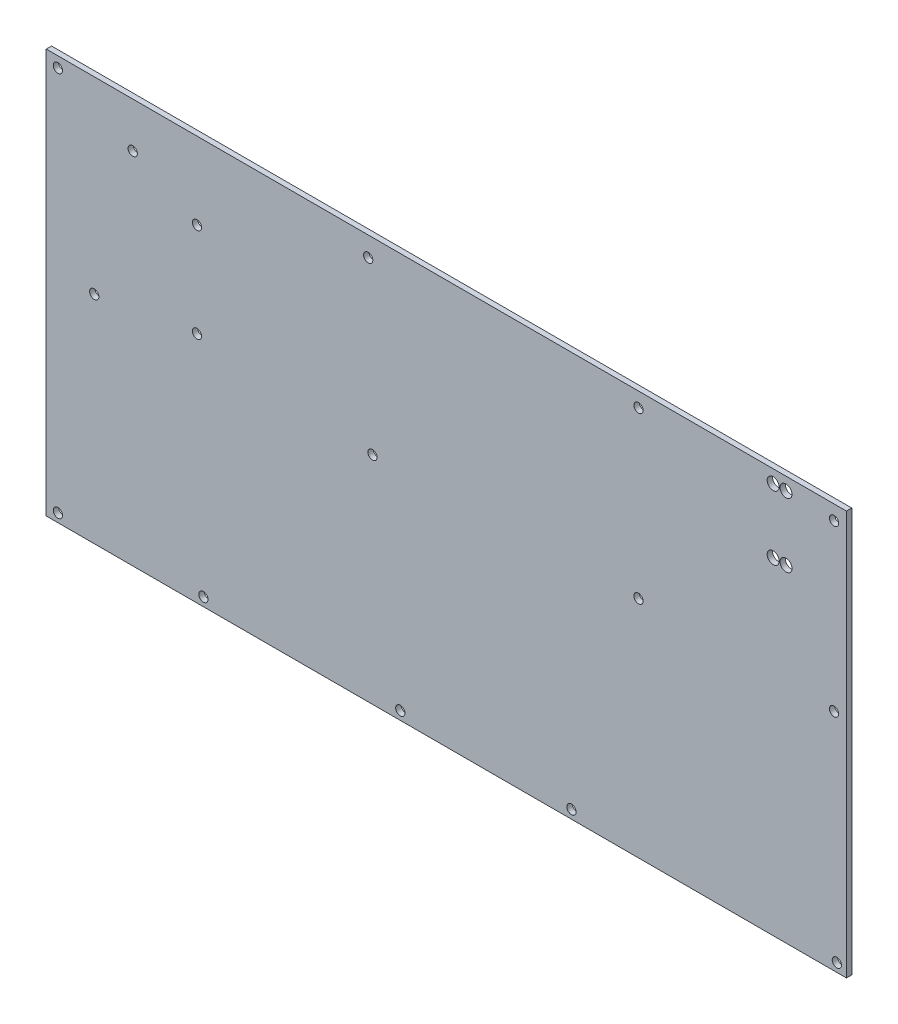
ISO-10303-21;
HEADER;
FILE_DESCRIPTION(('STEP AP214'),'2;1');
FILE_NAME('part.step','',(''),(''),'','','');
FILE_SCHEMA(('AUTOMOTIVE_DESIGN { 1 0 10303 214 1 1 1 1 }'));
ENDSEC;
DATA;
#1=APPLICATION_CONTEXT('core data for automotive mechanical design processes');
#2=APPLICATION_PROTOCOL_DEFINITION('international standard','automotive_design',2000,#1);
#3=PRODUCT_CONTEXT('',#1,'mechanical');
#4=PRODUCT('Part','Part','',(#3));
#5=PRODUCT_RELATED_PRODUCT_CATEGORY('part','',(#4));
#6=PRODUCT_DEFINITION_FORMATION('','',#4);
#7=PRODUCT_DEFINITION_CONTEXT('part definition',#1,'design');
#8=PRODUCT_DEFINITION('design','',#6,#7);
#9=PRODUCT_DEFINITION_SHAPE('','',#8);
#10=(LENGTH_UNIT() NAMED_UNIT(*) SI_UNIT(.MILLI.,.METRE.));
#11=(NAMED_UNIT(*) PLANE_ANGLE_UNIT() SI_UNIT($,.RADIAN.));
#12=(NAMED_UNIT(*) SI_UNIT($,.STERADIAN.) SOLID_ANGLE_UNIT());
#13=UNCERTAINTY_MEASURE_WITH_UNIT(LENGTH_MEASURE(1.E-05),#10,'distance_accuracy_value','');
#14=(GEOMETRIC_REPRESENTATION_CONTEXT(3) GLOBAL_UNCERTAINTY_ASSIGNED_CONTEXT((#13)) GLOBAL_UNIT_ASSIGNED_CONTEXT((#10,
#11,#12)) REPRESENTATION_CONTEXT('',''));
#15=CARTESIAN_POINT('',(0.,0.,0.));
#16=DIRECTION('',(0.,0.,1.));
#17=DIRECTION('',(1.,0.,0.));
#18=AXIS2_PLACEMENT_3D('',#15,#16,#17);
#19=CARTESIAN_POINT('',(0.,0.,7.5748));
#20=DIRECTION('',(0.,0.,-1.));
#21=DIRECTION('',(-1.,0.,0.));
#22=AXIS2_PLACEMENT_3D('',#19,#20,#21);
#23=PLANE('',#22);
#24=DIRECTION('',(0.,-1.,0.));
#25=VECTOR('',#24,1.);
#26=CARTESIAN_POINT('',(-39.9221568627452,-40.3820156862745,7.5748));
#27=LINE('',#26,#25);
#28=CARTESIAN_POINT('',(-39.9221568627452,79.6075843137255,7.5748));
#29=VERTEX_POINT('',#28);
#30=CARTESIAN_POINT('',(-39.9221568627452,-40.3820156862745,7.5748));
#31=VERTEX_POINT('',#30);
#32=EDGE_CURVE('E85',#29,#31,#27,.T.);
#33=ORIENTED_EDGE('',*,*,#32,.T.);
#34=DIRECTION('',(1.,0.,0.));
#35=VECTOR('',#34,1.);
#36=CARTESIAN_POINT('',(-39.9221568627452,-40.3820156862745,7.5748));
#37=LINE('',#36,#35);
#38=CARTESIAN_POINT('',(197.517043137255,-40.3820156862744,7.5748));
#39=VERTEX_POINT('',#38);
#40=EDGE_CURVE('E80',#31,#39,#37,.T.);
#41=ORIENTED_EDGE('',*,*,#40,.T.);
#42=DIRECTION('',(0.,1.,0.));
#43=VECTOR('',#42,1.);
#44=CARTESIAN_POINT('',(197.517043137255,-40.3820156862744,7.5748));
#45=LINE('',#44,#43);
#46=CARTESIAN_POINT('',(197.517043137255,79.6075843137255,7.5748));
#47=VERTEX_POINT('',#46);
#48=EDGE_CURVE('E83',#39,#47,#45,.T.);
#49=ORIENTED_EDGE('',*,*,#48,.T.);
#50=DIRECTION('',(-1.,0.,0.));
#51=VECTOR('',#50,1.);
#52=CARTESIAN_POINT('',(-39.9221568627452,79.6075843137255,7.5748));
#53=LINE('',#52,#51);
#54=EDGE_CURVE('E50',#47,#29,#53,.T.);
#55=ORIENTED_EDGE('',*,*,#54,.T.);
#56=EDGE_LOOP('',(#33,#41,#49,#55));
#57=FACE_BOUND('',#56,.T.);
#58=CARTESIAN_POINT('',(193.834043137255,75.2895843137255,7.5748));
#59=DIRECTION('',(0.,0.,1.));
#60=DIRECTION('',(1.,0.,0.));
#61=AXIS2_PLACEMENT_3D('',#58,#59,#60);
#62=CIRCLE('',#61,1.37159999999999);
#63=CARTESIAN_POINT('',(195.205643137255,75.2895843137255,7.5748));
#64=VERTEX_POINT('',#63);
#65=EDGE_CURVE('E100',#64,#64,#62,.T.);
#66=ORIENTED_EDGE('',*,*,#65,.F.);
#67=EDGE_LOOP('',(#66));
#68=FACE_BOUND('',#67,.T.);
#69=CARTESIAN_POINT('',(135.815363137255,75.2895843137255,7.5748));
#70=DIRECTION('',(0.,0.,1.));
#71=DIRECTION('',(1.,0.,0.));
#72=AXIS2_PLACEMENT_3D('',#69,#70,#71);
#73=CIRCLE('',#72,1.37159999999999);
#74=CARTESIAN_POINT('',(137.186963137255,75.2895843137255,7.5748));
#75=VERTEX_POINT('',#74);
#76=EDGE_CURVE('E115',#75,#75,#73,.T.);
#77=ORIENTED_EDGE('',*,*,#76,.F.);
#78=EDGE_LOOP('',(#77));
#79=FACE_BOUND('',#78,.T.);
#80=CARTESIAN_POINT('',(193.834043137255,26.2929843137255,7.5748));
#81=DIRECTION('',(0.,0.,1.));
#82=DIRECTION('',(1.,0.,0.));
#83=AXIS2_PLACEMENT_3D('',#80,#81,#82);
#84=CIRCLE('',#83,1.37159999999999);
#85=CARTESIAN_POINT('',(195.205643137255,26.2929843137255,7.5748));
#86=VERTEX_POINT('',#85);
#87=EDGE_CURVE('E121',#86,#86,#84,.T.);
#88=ORIENTED_EDGE('',*,*,#87,.F.);
#89=EDGE_LOOP('',(#88));
#90=FACE_BOUND('',#89,.T.);
#91=CARTESIAN_POINT('',(135.820443137255,26.2929843137255,7.5748));
#92=DIRECTION('',(0.,0.,1.));
#93=DIRECTION('',(1.,0.,0.));
#94=AXIS2_PLACEMENT_3D('',#91,#92,#93);
#95=CIRCLE('',#94,1.37159999999999);
#96=CARTESIAN_POINT('',(137.192043137255,26.2929843137255,7.5748));
#97=VERTEX_POINT('',#96);
#98=EDGE_CURVE('E127',#97,#97,#95,.T.);
#99=ORIENTED_EDGE('',*,*,#98,.F.);
#100=EDGE_LOOP('',(#99));
#101=FACE_BOUND('',#100,.T.);
#102=CARTESIAN_POINT('',(194.672243137255,-37.8420156862745,7.5748));
#103=DIRECTION('',(0.,0.,1.));
#104=DIRECTION('',(1.,0.,0.));
#105=AXIS2_PLACEMENT_3D('',#102,#103,#104);
#106=CIRCLE('',#105,1.37159999999999);
#107=CARTESIAN_POINT('',(196.043843137255,-37.8420156862745,7.5748));
#108=VERTEX_POINT('',#107);
#109=EDGE_CURVE('E133',#108,#108,#106,.T.);
#110=ORIENTED_EDGE('',*,*,#109,.F.);
#111=EDGE_LOOP('',(#110));
#112=FACE_BOUND('',#111,.T.);
#113=CARTESIAN_POINT('',(115.932243137255,-37.8420156862745,7.5748));
#114=DIRECTION('',(0.,0.,1.));
#115=DIRECTION('',(1.,0.,0.));
#116=AXIS2_PLACEMENT_3D('',#113,#114,#115);
#117=CIRCLE('',#116,1.37159999999999);
#118=CARTESIAN_POINT('',(117.303843137255,-37.8420156862745,7.5748));
#119=VERTEX_POINT('',#118);
#120=EDGE_CURVE('E139',#119,#119,#117,.T.);
#121=ORIENTED_EDGE('',*,*,#120,.F.);
#122=EDGE_LOOP('',(#121));
#123=FACE_BOUND('',#122,.T.);
#124=CARTESIAN_POINT('',(55.6072431372549,73.7909843137255,7.5748));
#125=DIRECTION('',(0.,0.,1.));
#126=DIRECTION('',(1.,0.,0.));
#127=AXIS2_PLACEMENT_3D('',#124,#125,#126);
#128=CIRCLE('',#127,1.3716);
#129=CARTESIAN_POINT('',(56.9788431372549,73.7909843137255,7.5748));
#130=VERTEX_POINT('',#129);
#131=EDGE_CURVE('E145',#130,#130,#128,.T.);
#132=ORIENTED_EDGE('',*,*,#131,.F.);
#133=EDGE_LOOP('',(#132));
#134=FACE_BOUND('',#133,.T.);
#135=CARTESIAN_POINT('',(56.8772431372549,23.7529843137255,7.5748));
#136=DIRECTION('',(0.,0.,1.));
#137=DIRECTION('',(1.,0.,0.));
#138=AXIS2_PLACEMENT_3D('',#135,#136,#137);
#139=CIRCLE('',#138,1.3716);
#140=CARTESIAN_POINT('',(58.2488431372549,23.7529843137255,7.5748));
#141=VERTEX_POINT('',#140);
#142=EDGE_CURVE('E151',#141,#141,#139,.T.);
#143=ORIENTED_EDGE('',*,*,#142,.F.);
#144=EDGE_LOOP('',(#143));
#145=FACE_BOUND('',#144,.T.);
#146=CARTESIAN_POINT('',(65.1322431372549,-37.8420156862745,7.5748));
#147=DIRECTION('',(0.,0.,1.));
#148=DIRECTION('',(1.,0.,0.));
#149=AXIS2_PLACEMENT_3D('',#146,#147,#148);
#150=CIRCLE('',#149,1.3716);
#151=CARTESIAN_POINT('',(66.5038431372549,-37.8420156862745,7.5748));
#152=VERTEX_POINT('',#151);
#153=EDGE_CURVE('E157',#152,#152,#150,.T.);
#154=ORIENTED_EDGE('',*,*,#153,.F.);
#155=EDGE_LOOP('',(#154));
#156=FACE_BOUND('',#155,.T.);
#157=CARTESIAN_POINT('',(4.80724313725489,56.7729843137255,7.5748));
#158=DIRECTION('',(0.,0.,1.));
#159=DIRECTION('',(1.,0.,0.));
#160=AXIS2_PLACEMENT_3D('',#157,#158,#159);
#161=CIRCLE('',#160,1.3716);
#162=CARTESIAN_POINT('',(6.1788431372549,56.7729843137255,7.5748));
#163=VERTEX_POINT('',#162);
#164=EDGE_CURVE('E163',#163,#163,#161,.T.);
#165=ORIENTED_EDGE('',*,*,#164,.F.);
#166=EDGE_LOOP('',(#165));
#167=FACE_BOUND('',#166,.T.);
#168=CARTESIAN_POINT('',(4.80724313725492,28.8329843137255,7.5748));
#169=DIRECTION('',(0.,0.,1.));
#170=DIRECTION('',(1.,0.,0.));
#171=AXIS2_PLACEMENT_3D('',#168,#169,#170);
#172=CIRCLE('',#171,1.3716);
#173=CARTESIAN_POINT('',(6.17884313725492,28.8329843137255,7.5748));
#174=VERTEX_POINT('',#173);
#175=EDGE_CURVE('E169',#174,#174,#172,.T.);
#176=ORIENTED_EDGE('',*,*,#175,.F.);
#177=EDGE_LOOP('',(#176));
#178=FACE_BOUND('',#177,.T.);
#179=CARTESIAN_POINT('',(6.71224313725488,-37.8420156862745,7.5748));
#180=DIRECTION('',(0.,0.,1.));
#181=DIRECTION('',(1.,0.,0.));
#182=AXIS2_PLACEMENT_3D('',#179,#180,#181);
#183=CIRCLE('',#182,1.3716);
#184=CARTESIAN_POINT('',(8.08384313725488,-37.8420156862745,7.5748));
#185=VERTEX_POINT('',#184);
#186=EDGE_CURVE('E175',#185,#185,#183,.T.);
#187=ORIENTED_EDGE('',*,*,#186,.F.);
#188=EDGE_LOOP('',(#187));
#189=FACE_BOUND('',#188,.T.);
#190=CARTESIAN_POINT('',(-14.2717788706648,66.2672357657925,7.5748));
#191=DIRECTION('',(0.,0.,1.));
#192=DIRECTION('',(1.,0.,0.));
#193=AXIS2_PLACEMENT_3D('',#190,#191,#192);
#194=CIRCLE('',#193,1.3716);
#195=CARTESIAN_POINT('',(-12.9001788706648,66.2672357657925,7.5748));
#196=VERTEX_POINT('',#195);
#197=EDGE_CURVE('E181',#196,#196,#194,.T.);
#198=ORIENTED_EDGE('',*,*,#197,.F.);
#199=EDGE_LOOP('',(#198));
#200=FACE_BOUND('',#199,.T.);
#201=CARTESIAN_POINT('',(-36.4677568627451,76.4833843137255,7.5748));
#202=DIRECTION('',(0.,0.,1.));
#203=DIRECTION('',(1.,0.,0.));
#204=AXIS2_PLACEMENT_3D('',#201,#202,#203);
#205=CIRCLE('',#204,1.3716);
#206=CARTESIAN_POINT('',(-35.0961568627451,76.4833843137255,7.5748));
#207=VERTEX_POINT('',#206);
#208=EDGE_CURVE('E187',#207,#207,#205,.T.);
#209=ORIENTED_EDGE('',*,*,#208,.F.);
#210=EDGE_LOOP('',(#209));
#211=FACE_BOUND('',#210,.T.);
#212=CARTESIAN_POINT('',(-25.6727568627451,23.7529843137255,7.5748));
#213=DIRECTION('',(0.,0.,1.));
#214=DIRECTION('',(1.,0.,0.));
#215=AXIS2_PLACEMENT_3D('',#212,#213,#214);
#216=CIRCLE('',#215,1.3716);
#217=CARTESIAN_POINT('',(-24.3011568627451,23.7529843137255,7.5748));
#218=VERTEX_POINT('',#217);
#219=EDGE_CURVE('E193',#218,#218,#216,.T.);
#220=ORIENTED_EDGE('',*,*,#219,.F.);
#221=EDGE_LOOP('',(#220));
#222=FACE_BOUND('',#221,.T.);
#223=CARTESIAN_POINT('',(-36.4677568627451,-37.8420156862745,7.5748));
#224=DIRECTION('',(0.,0.,1.));
#225=DIRECTION('',(1.,0.,0.));
#226=AXIS2_PLACEMENT_3D('',#223,#224,#225);
#227=CIRCLE('',#226,1.3716);
#228=CARTESIAN_POINT('',(-35.0961568627451,-37.8420156862745,7.5748));
#229=VERTEX_POINT('',#228);
#230=EDGE_CURVE('E199',#229,#229,#227,.T.);
#231=ORIENTED_EDGE('',*,*,#230,.F.);
#232=EDGE_LOOP('',(#231));
#233=FACE_BOUND('',#232,.T.);
#234=CARTESIAN_POINT('',(179.584643137255,75.8229843137255,7.5748));
#235=DIRECTION('',(0.,0.,1.));
#236=DIRECTION('',(1.,0.,0.));
#237=AXIS2_PLACEMENT_3D('',#234,#235,#236);
#238=CIRCLE('',#237,1.778);
#239=CARTESIAN_POINT('',(181.362643137255,75.8229843137255,7.5748));
#240=VERTEX_POINT('',#239);
#241=EDGE_CURVE('E205',#240,#240,#238,.T.);
#242=ORIENTED_EDGE('',*,*,#241,.F.);
#243=EDGE_LOOP('',(#242));
#244=FACE_BOUND('',#243,.T.);
#245=CARTESIAN_POINT('',(175.774643137255,75.7975843137255,7.5748));
#246=DIRECTION('',(0.,0.,1.));
#247=DIRECTION('',(1.,0.,0.));
#248=AXIS2_PLACEMENT_3D('',#245,#246,#247);
#249=CIRCLE('',#248,1.778);
#250=CARTESIAN_POINT('',(177.552643137255,75.7975843137255,7.5748));
#251=VERTEX_POINT('',#250);
#252=EDGE_CURVE('E211',#251,#251,#249,.T.);
#253=ORIENTED_EDGE('',*,*,#252,.F.);
#254=EDGE_LOOP('',(#253));
#255=FACE_BOUND('',#254,.T.);
#256=CARTESIAN_POINT('',(179.584643137255,56.7475843137255,7.5748));
#257=DIRECTION('',(0.,0.,1.));
#258=DIRECTION('',(1.,0.,0.));
#259=AXIS2_PLACEMENT_3D('',#256,#257,#258);
#260=CIRCLE('',#259,1.77800000000001);
#261=CARTESIAN_POINT('',(181.362643137255,56.7475843137255,7.5748));
#262=VERTEX_POINT('',#261);
#263=EDGE_CURVE('E217',#262,#262,#260,.T.);
#264=ORIENTED_EDGE('',*,*,#263,.F.);
#265=EDGE_LOOP('',(#264));
#266=FACE_BOUND('',#265,.T.);
#267=CARTESIAN_POINT('',(175.774643137255,56.7475843137255,7.5748));
#268=DIRECTION('',(0.,0.,1.));
#269=DIRECTION('',(1.,0.,0.));
#270=AXIS2_PLACEMENT_3D('',#267,#268,#269);
#271=CIRCLE('',#270,1.77800000000001);
#272=CARTESIAN_POINT('',(177.552643137255,56.7475843137255,7.5748));
#273=VERTEX_POINT('',#272);
#274=EDGE_CURVE('E223',#273,#273,#271,.T.);
#275=ORIENTED_EDGE('',*,*,#274,.F.);
#276=EDGE_LOOP('',(#275));
#277=FACE_BOUND('',#276,.T.);
#278=ADVANCED_FACE('F33',(#57,#68,#79,#90,#101,#112,#123,#134,#145,#156,#167,#178,#189,#200,
#211,#222,#233,#244,#255,#266,#277),#23,.F.);
#279=CARTESIAN_POINT('',(0.,0.,6.));
#280=DIRECTION('',(0.,0.,-1.));
#281=DIRECTION('',(-1.,0.,0.));
#282=AXIS2_PLACEMENT_3D('',#279,#280,#281);
#283=PLANE('',#282);
#284=CARTESIAN_POINT('',(179.584643137255,56.7475843137255,6.));
#285=DIRECTION('',(0.,0.,1.));
#286=DIRECTION('',(1.,0.,0.));
#287=AXIS2_PLACEMENT_3D('',#284,#285,#286);
#288=CIRCLE('',#287,1.77800000000001);
#289=CARTESIAN_POINT('',(181.362643137255,56.7475843137255,6.));
#290=VERTEX_POINT('',#289);
#291=EDGE_CURVE('E220',#290,#290,#288,.T.);
#292=ORIENTED_EDGE('',*,*,#291,.T.);
#293=EDGE_LOOP('',(#292));
#294=FACE_BOUND('',#293,.T.);
#295=CARTESIAN_POINT('',(179.584643137255,75.8229843137255,6.));
#296=DIRECTION('',(0.,0.,1.));
#297=DIRECTION('',(1.,0.,0.));
#298=AXIS2_PLACEMENT_3D('',#295,#296,#297);
#299=CIRCLE('',#298,1.778);
#300=CARTESIAN_POINT('',(181.362643137255,75.8229843137255,6.));
#301=VERTEX_POINT('',#300);
#302=EDGE_CURVE('E208',#301,#301,#299,.T.);
#303=ORIENTED_EDGE('',*,*,#302,.T.);
#304=EDGE_LOOP('',(#303));
#305=FACE_BOUND('',#304,.T.);
#306=CARTESIAN_POINT('',(-25.6727568627451,23.7529843137255,6.));
#307=DIRECTION('',(0.,0.,1.));
#308=DIRECTION('',(1.,0.,0.));
#309=AXIS2_PLACEMENT_3D('',#306,#307,#308);
#310=CIRCLE('',#309,1.3716);
#311=CARTESIAN_POINT('',(-24.3011568627451,23.7529843137255,6.));
#312=VERTEX_POINT('',#311);
#313=EDGE_CURVE('E196',#312,#312,#310,.T.);
#314=ORIENTED_EDGE('',*,*,#313,.T.);
#315=EDGE_LOOP('',(#314));
#316=FACE_BOUND('',#315,.T.);
#317=CARTESIAN_POINT('',(-14.2717788706648,66.2672357657925,6.));
#318=DIRECTION('',(0.,0.,1.));
#319=DIRECTION('',(1.,0.,0.));
#320=AXIS2_PLACEMENT_3D('',#317,#318,#319);
#321=CIRCLE('',#320,1.3716);
#322=CARTESIAN_POINT('',(-12.9001788706648,66.2672357657925,6.));
#323=VERTEX_POINT('',#322);
#324=EDGE_CURVE('E184',#323,#323,#321,.T.);
#325=ORIENTED_EDGE('',*,*,#324,.T.);
#326=EDGE_LOOP('',(#325));
#327=FACE_BOUND('',#326,.T.);
#328=CARTESIAN_POINT('',(4.80724313725492,28.8329843137255,6.));
#329=DIRECTION('',(0.,0.,1.));
#330=DIRECTION('',(1.,0.,0.));
#331=AXIS2_PLACEMENT_3D('',#328,#329,#330);
#332=CIRCLE('',#331,1.3716);
#333=CARTESIAN_POINT('',(6.17884313725492,28.8329843137255,6.));
#334=VERTEX_POINT('',#333);
#335=EDGE_CURVE('E172',#334,#334,#332,.T.);
#336=ORIENTED_EDGE('',*,*,#335,.T.);
#337=EDGE_LOOP('',(#336));
#338=FACE_BOUND('',#337,.T.);
#339=CARTESIAN_POINT('',(65.1322431372549,-37.8420156862745,6.));
#340=DIRECTION('',(0.,0.,1.));
#341=DIRECTION('',(1.,0.,0.));
#342=AXIS2_PLACEMENT_3D('',#339,#340,#341);
#343=CIRCLE('',#342,1.3716);
#344=CARTESIAN_POINT('',(66.5038431372549,-37.8420156862745,6.));
#345=VERTEX_POINT('',#344);
#346=EDGE_CURVE('E160',#345,#345,#343,.T.);
#347=ORIENTED_EDGE('',*,*,#346,.T.);
#348=EDGE_LOOP('',(#347));
#349=FACE_BOUND('',#348,.T.);
#350=CARTESIAN_POINT('',(55.6072431372549,73.7909843137255,6.));
#351=DIRECTION('',(0.,0.,1.));
#352=DIRECTION('',(1.,0.,0.));
#353=AXIS2_PLACEMENT_3D('',#350,#351,#352);
#354=CIRCLE('',#353,1.3716);
#355=CARTESIAN_POINT('',(56.9788431372549,73.7909843137255,6.));
#356=VERTEX_POINT('',#355);
#357=EDGE_CURVE('E148',#356,#356,#354,.T.);
#358=ORIENTED_EDGE('',*,*,#357,.T.);
#359=EDGE_LOOP('',(#358));
#360=FACE_BOUND('',#359,.T.);
#361=CARTESIAN_POINT('',(194.672243137255,-37.8420156862745,6.));
#362=DIRECTION('',(0.,0.,1.));
#363=DIRECTION('',(1.,0.,0.));
#364=AXIS2_PLACEMENT_3D('',#361,#362,#363);
#365=CIRCLE('',#364,1.37159999999999);
#366=CARTESIAN_POINT('',(196.043843137255,-37.8420156862745,6.));
#367=VERTEX_POINT('',#366);
#368=EDGE_CURVE('E136',#367,#367,#365,.T.);
#369=ORIENTED_EDGE('',*,*,#368,.T.);
#370=EDGE_LOOP('',(#369));
#371=FACE_BOUND('',#370,.T.);
#372=CARTESIAN_POINT('',(193.834043137255,26.2929843137255,6.));
#373=DIRECTION('',(0.,0.,1.));
#374=DIRECTION('',(1.,0.,0.));
#375=AXIS2_PLACEMENT_3D('',#372,#373,#374);
#376=CIRCLE('',#375,1.37159999999999);
#377=CARTESIAN_POINT('',(195.205643137255,26.2929843137255,6.));
#378=VERTEX_POINT('',#377);
#379=EDGE_CURVE('E124',#378,#378,#376,.T.);
#380=ORIENTED_EDGE('',*,*,#379,.T.);
#381=EDGE_LOOP('',(#380));
#382=FACE_BOUND('',#381,.T.);
#383=CARTESIAN_POINT('',(193.834043137255,75.2895843137255,6.));
#384=DIRECTION('',(0.,0.,1.));
#385=DIRECTION('',(1.,0.,0.));
#386=AXIS2_PLACEMENT_3D('',#383,#384,#385);
#387=CIRCLE('',#386,1.37159999999999);
#388=CARTESIAN_POINT('',(195.205643137255,75.2895843137255,6.));
#389=VERTEX_POINT('',#388);
#390=EDGE_CURVE('E112',#389,#389,#387,.T.);
#391=ORIENTED_EDGE('',*,*,#390,.T.);
#392=EDGE_LOOP('',(#391));
#393=FACE_BOUND('',#392,.T.);
#394=DIRECTION('',(0.,-1.,0.));
#395=VECTOR('',#394,1.);
#396=CARTESIAN_POINT('',(-39.9221568627452,-40.3820156862745,6.));
#397=LINE('',#396,#395);
#398=CARTESIAN_POINT('',(-39.9221568627452,79.6075843137255,6.));
#399=VERTEX_POINT('',#398);
#400=CARTESIAN_POINT('',(-39.9221568627452,-40.3820156862745,6.));
#401=VERTEX_POINT('',#400);
#402=EDGE_CURVE('E97',#399,#401,#397,.T.);
#403=ORIENTED_EDGE('',*,*,#402,.F.);
#404=DIRECTION('',(-1.,0.,0.));
#405=VECTOR('',#404,1.);
#406=CARTESIAN_POINT('',(-39.9221568627452,79.6075843137255,6.));
#407=LINE('',#406,#405);
#408=CARTESIAN_POINT('',(197.517043137255,79.6075843137255,6.));
#409=VERTEX_POINT('',#408);
#410=EDGE_CURVE('E73',#409,#399,#407,.T.);
#411=ORIENTED_EDGE('',*,*,#410,.F.);
#412=DIRECTION('',(0.,1.,0.));
#413=VECTOR('',#412,1.);
#414=CARTESIAN_POINT('',(197.517043137255,-40.3820156862744,6.));
#415=LINE('',#414,#413);
#416=CARTESIAN_POINT('',(197.517043137255,-40.3820156862744,6.));
#417=VERTEX_POINT('',#416);
#418=EDGE_CURVE('E67',#417,#409,#415,.T.);
#419=ORIENTED_EDGE('',*,*,#418,.F.);
#420=DIRECTION('',(1.,0.,0.));
#421=VECTOR('',#420,1.);
#422=CARTESIAN_POINT('',(-39.9221568627452,-40.3820156862745,6.));
#423=LINE('',#422,#421);
#424=EDGE_CURVE('E89',#401,#417,#423,.T.);
#425=ORIENTED_EDGE('',*,*,#424,.F.);
#426=EDGE_LOOP('',(#403,#411,#419,#425));
#427=FACE_BOUND('',#426,.T.);
#428=CARTESIAN_POINT('',(135.815363137255,75.2895843137255,6.));
#429=DIRECTION('',(0.,0.,1.));
#430=DIRECTION('',(1.,0.,0.));
#431=AXIS2_PLACEMENT_3D('',#428,#429,#430);
#432=CIRCLE('',#431,1.37159999999999);
#433=CARTESIAN_POINT('',(137.186963137255,75.2895843137255,6.));
#434=VERTEX_POINT('',#433);
#435=EDGE_CURVE('E118',#434,#434,#432,.T.);
#436=ORIENTED_EDGE('',*,*,#435,.T.);
#437=EDGE_LOOP('',(#436));
#438=FACE_BOUND('',#437,.T.);
#439=CARTESIAN_POINT('',(135.820443137255,26.2929843137255,6.));
#440=DIRECTION('',(0.,0.,1.));
#441=DIRECTION('',(1.,0.,0.));
#442=AXIS2_PLACEMENT_3D('',#439,#440,#441);
#443=CIRCLE('',#442,1.37159999999999);
#444=CARTESIAN_POINT('',(137.192043137255,26.2929843137255,6.));
#445=VERTEX_POINT('',#444);
#446=EDGE_CURVE('E130',#445,#445,#443,.T.);
#447=ORIENTED_EDGE('',*,*,#446,.T.);
#448=EDGE_LOOP('',(#447));
#449=FACE_BOUND('',#448,.T.);
#450=CARTESIAN_POINT('',(115.932243137255,-37.8420156862745,6.));
#451=DIRECTION('',(0.,0.,1.));
#452=DIRECTION('',(1.,0.,0.));
#453=AXIS2_PLACEMENT_3D('',#450,#451,#452);
#454=CIRCLE('',#453,1.37159999999999);
#455=CARTESIAN_POINT('',(117.303843137255,-37.8420156862745,6.));
#456=VERTEX_POINT('',#455);
#457=EDGE_CURVE('E142',#456,#456,#454,.T.);
#458=ORIENTED_EDGE('',*,*,#457,.T.);
#459=EDGE_LOOP('',(#458));
#460=FACE_BOUND('',#459,.T.);
#461=CARTESIAN_POINT('',(56.8772431372549,23.7529843137255,6.));
#462=DIRECTION('',(0.,0.,1.));
#463=DIRECTION('',(1.,0.,0.));
#464=AXIS2_PLACEMENT_3D('',#461,#462,#463);
#465=CIRCLE('',#464,1.3716);
#466=CARTESIAN_POINT('',(58.2488431372549,23.7529843137255,6.));
#467=VERTEX_POINT('',#466);
#468=EDGE_CURVE('E154',#467,#467,#465,.T.);
#469=ORIENTED_EDGE('',*,*,#468,.T.);
#470=EDGE_LOOP('',(#469));
#471=FACE_BOUND('',#470,.T.);
#472=CARTESIAN_POINT('',(4.80724313725489,56.7729843137255,6.));
#473=DIRECTION('',(0.,0.,1.));
#474=DIRECTION('',(1.,0.,0.));
#475=AXIS2_PLACEMENT_3D('',#472,#473,#474);
#476=CIRCLE('',#475,1.3716);
#477=CARTESIAN_POINT('',(6.1788431372549,56.7729843137255,6.));
#478=VERTEX_POINT('',#477);
#479=EDGE_CURVE('E166',#478,#478,#476,.T.);
#480=ORIENTED_EDGE('',*,*,#479,.T.);
#481=EDGE_LOOP('',(#480));
#482=FACE_BOUND('',#481,.T.);
#483=CARTESIAN_POINT('',(6.71224313725488,-37.8420156862745,6.));
#484=DIRECTION('',(0.,0.,1.));
#485=DIRECTION('',(1.,0.,0.));
#486=AXIS2_PLACEMENT_3D('',#483,#484,#485);
#487=CIRCLE('',#486,1.3716);
#488=CARTESIAN_POINT('',(8.08384313725488,-37.8420156862745,6.));
#489=VERTEX_POINT('',#488);
#490=EDGE_CURVE('E178',#489,#489,#487,.T.);
#491=ORIENTED_EDGE('',*,*,#490,.T.);
#492=EDGE_LOOP('',(#491));
#493=FACE_BOUND('',#492,.T.);
#494=CARTESIAN_POINT('',(-36.4677568627451,76.4833843137255,6.));
#495=DIRECTION('',(0.,0.,1.));
#496=DIRECTION('',(1.,0.,0.));
#497=AXIS2_PLACEMENT_3D('',#494,#495,#496);
#498=CIRCLE('',#497,1.3716);
#499=CARTESIAN_POINT('',(-35.0961568627451,76.4833843137255,6.));
#500=VERTEX_POINT('',#499);
#501=EDGE_CURVE('E190',#500,#500,#498,.T.);
#502=ORIENTED_EDGE('',*,*,#501,.T.);
#503=EDGE_LOOP('',(#502));
#504=FACE_BOUND('',#503,.T.);
#505=CARTESIAN_POINT('',(-36.4677568627451,-37.8420156862745,6.));
#506=DIRECTION('',(0.,0.,1.));
#507=DIRECTION('',(1.,0.,0.));
#508=AXIS2_PLACEMENT_3D('',#505,#506,#507);
#509=CIRCLE('',#508,1.3716);
#510=CARTESIAN_POINT('',(-35.0961568627451,-37.8420156862745,6.));
#511=VERTEX_POINT('',#510);
#512=EDGE_CURVE('E202',#511,#511,#509,.T.);
#513=ORIENTED_EDGE('',*,*,#512,.T.);
#514=EDGE_LOOP('',(#513));
#515=FACE_BOUND('',#514,.T.);
#516=CARTESIAN_POINT('',(175.774643137255,75.7975843137255,6.));
#517=DIRECTION('',(0.,0.,1.));
#518=DIRECTION('',(1.,0.,0.));
#519=AXIS2_PLACEMENT_3D('',#516,#517,#518);
#520=CIRCLE('',#519,1.778);
#521=CARTESIAN_POINT('',(177.552643137255,75.7975843137255,6.));
#522=VERTEX_POINT('',#521);
#523=EDGE_CURVE('E214',#522,#522,#520,.T.);
#524=ORIENTED_EDGE('',*,*,#523,.T.);
#525=EDGE_LOOP('',(#524));
#526=FACE_BOUND('',#525,.T.);
#527=CARTESIAN_POINT('',(175.774643137255,56.7475843137255,6.));
#528=DIRECTION('',(0.,0.,1.));
#529=DIRECTION('',(1.,0.,0.));
#530=AXIS2_PLACEMENT_3D('',#527,#528,#529);
#531=CIRCLE('',#530,1.77800000000001);
#532=CARTESIAN_POINT('',(177.552643137255,56.7475843137255,6.));
#533=VERTEX_POINT('',#532);
#534=EDGE_CURVE('E226',#533,#533,#531,.T.);
#535=ORIENTED_EDGE('',*,*,#534,.T.);
#536=EDGE_LOOP('',(#535));
#537=FACE_BOUND('',#536,.T.);
#538=ADVANCED_FACE('F108',(#294,#305,#316,#327,#338,#349,#360,#371,#382,#393,#427,#438,#449,
#460,#471,#482,#493,#504,#515,#526,#537),#283,.T.);
#539=CARTESIAN_POINT('',(-39.9221568627452,-40.3820156862745,7.5748));
#540=DIRECTION('',(1.,0.,0.));
#541=DIRECTION('',(0.,1.,0.));
#542=AXIS2_PLACEMENT_3D('',#539,#540,#541);
#543=PLANE('',#542);
#544=ORIENTED_EDGE('',*,*,#402,.T.);
#545=DIRECTION('',(0.,0.,-1.));
#546=VECTOR('',#545,1.);
#547=CARTESIAN_POINT('',(-39.9221568627452,-40.3820156862745,7.5748));
#548=LINE('',#547,#546);
#549=EDGE_CURVE('E11',#31,#401,#548,.T.);
#550=ORIENTED_EDGE('',*,*,#549,.F.);
#551=ORIENTED_EDGE('',*,*,#32,.F.);
#552=DIRECTION('',(0.,0.,-1.));
#553=VECTOR('',#552,1.);
#554=CARTESIAN_POINT('',(-39.9221568627452,79.6075843137255,7.5748));
#555=LINE('',#554,#553);
#556=EDGE_CURVE('E93',#29,#399,#555,.T.);
#557=ORIENTED_EDGE('',*,*,#556,.T.);
#558=EDGE_LOOP('',(#544,#550,#551,#557));
#559=FACE_BOUND('',#558,.T.);
#560=ADVANCED_FACE('F35',(#559),#543,.F.);
#561=CARTESIAN_POINT('',(-39.9221568627452,-40.3820156862745,7.5748));
#562=DIRECTION('',(0.,1.,0.));
#563=DIRECTION('',(-1.,0.,0.));
#564=AXIS2_PLACEMENT_3D('',#561,#562,#563);
#565=PLANE('',#564);
#566=ORIENTED_EDGE('',*,*,#424,.T.);
#567=DIRECTION('',(0.,0.,-1.));
#568=VECTOR('',#567,1.);
#569=CARTESIAN_POINT('',(197.517043137255,-40.3820156862744,7.5748));
#570=LINE('',#569,#568);
#571=EDGE_CURVE('E42',#39,#417,#570,.T.);
#572=ORIENTED_EDGE('',*,*,#571,.F.);
#573=ORIENTED_EDGE('',*,*,#40,.F.);
#574=ORIENTED_EDGE('',*,*,#549,.T.);
#575=EDGE_LOOP('',(#566,#572,#573,#574));
#576=FACE_BOUND('',#575,.T.);
#577=ADVANCED_FACE('F88',(#576),#565,.F.);
#578=CARTESIAN_POINT('',(197.517043137255,-40.3820156862744,7.5748));
#579=DIRECTION('',(-1.,0.,0.));
#580=DIRECTION('',(0.,-1.,0.));
#581=AXIS2_PLACEMENT_3D('',#578,#579,#580);
#582=PLANE('',#581);
#583=ORIENTED_EDGE('',*,*,#418,.T.);
#584=DIRECTION('',(0.,0.,-1.));
#585=VECTOR('',#584,1.);
#586=CARTESIAN_POINT('',(197.517043137255,79.6075843137255,7.5748));
#587=LINE('',#586,#585);
#588=EDGE_CURVE('E90',#47,#409,#587,.T.);
#589=ORIENTED_EDGE('',*,*,#588,.F.);
#590=ORIENTED_EDGE('',*,*,#48,.F.);
#591=ORIENTED_EDGE('',*,*,#571,.T.);
#592=EDGE_LOOP('',(#583,#589,#590,#591));
#593=FACE_BOUND('',#592,.T.);
#594=ADVANCED_FACE('F91',(#593),#582,.F.);
#595=CARTESIAN_POINT('',(-39.9221568627452,79.6075843137255,7.5748));
#596=DIRECTION('',(0.,-1.,0.));
#597=DIRECTION('',(0.,0.,-1.));
#598=AXIS2_PLACEMENT_3D('',#595,#596,#597);
#599=PLANE('',#598);
#600=ORIENTED_EDGE('',*,*,#410,.T.);
#601=ORIENTED_EDGE('',*,*,#556,.F.);
#602=ORIENTED_EDGE('',*,*,#54,.F.);
#603=ORIENTED_EDGE('',*,*,#588,.T.);
#604=EDGE_LOOP('',(#600,#601,#602,#603));
#605=FACE_BOUND('',#604,.T.);
#606=ADVANCED_FACE('F105',(#605),#599,.F.);
#607=CARTESIAN_POINT('',(193.834043137255,75.2895843137255,7.5748));
#608=DIRECTION('',(0.,0.,-1.));
#609=DIRECTION('',(-1.,0.,0.));
#610=AXIS2_PLACEMENT_3D('',#607,#608,#609);
#611=CYLINDRICAL_SURFACE('',#610,1.37159999999999);
#612=ORIENTED_EDGE('',*,*,#65,.T.);
#613=EDGE_LOOP('',(#612));
#614=FACE_BOUND('',#613,.T.);
#615=ORIENTED_EDGE('',*,*,#390,.F.);
#616=EDGE_LOOP('',(#615));
#617=FACE_BOUND('',#616,.T.);
#618=ADVANCED_FACE('F243',(#614,#617),#611,.F.);
#619=CARTESIAN_POINT('',(135.815363137255,75.2895843137255,7.5748));
#620=DIRECTION('',(0.,0.,-1.));
#621=DIRECTION('',(-1.,0.,0.));
#622=AXIS2_PLACEMENT_3D('',#619,#620,#621);
#623=CYLINDRICAL_SURFACE('',#622,1.37159999999999);
#624=ORIENTED_EDGE('',*,*,#76,.T.);
#625=EDGE_LOOP('',(#624));
#626=FACE_BOUND('',#625,.T.);
#627=ORIENTED_EDGE('',*,*,#435,.F.);
#628=EDGE_LOOP('',(#627));
#629=FACE_BOUND('',#628,.T.);
#630=ADVANCED_FACE('F289',(#626,#629),#623,.F.);
#631=CARTESIAN_POINT('',(193.834043137255,26.2929843137255,7.5748));
#632=DIRECTION('',(0.,0.,-1.));
#633=DIRECTION('',(-1.,0.,0.));
#634=AXIS2_PLACEMENT_3D('',#631,#632,#633);
#635=CYLINDRICAL_SURFACE('',#634,1.37159999999999);
#636=ORIENTED_EDGE('',*,*,#87,.T.);
#637=EDGE_LOOP('',(#636));
#638=FACE_BOUND('',#637,.T.);
#639=ORIENTED_EDGE('',*,*,#379,.F.);
#640=EDGE_LOOP('',(#639));
#641=FACE_BOUND('',#640,.T.);
#642=ADVANCED_FACE('F297',(#638,#641),#635,.F.);
#643=CARTESIAN_POINT('',(135.820443137255,26.2929843137255,7.5748));
#644=DIRECTION('',(0.,0.,-1.));
#645=DIRECTION('',(-1.,0.,0.));
#646=AXIS2_PLACEMENT_3D('',#643,#644,#645);
#647=CYLINDRICAL_SURFACE('',#646,1.37159999999999);
#648=ORIENTED_EDGE('',*,*,#98,.T.);
#649=EDGE_LOOP('',(#648));
#650=FACE_BOUND('',#649,.T.);
#651=ORIENTED_EDGE('',*,*,#446,.F.);
#652=EDGE_LOOP('',(#651));
#653=FACE_BOUND('',#652,.T.);
#654=ADVANCED_FACE('F305',(#650,#653),#647,.F.);
#655=CARTESIAN_POINT('',(194.672243137255,-37.8420156862745,7.5748));
#656=DIRECTION('',(0.,0.,-1.));
#657=DIRECTION('',(-1.,0.,0.));
#658=AXIS2_PLACEMENT_3D('',#655,#656,#657);
#659=CYLINDRICAL_SURFACE('',#658,1.37159999999999);
#660=ORIENTED_EDGE('',*,*,#109,.T.);
#661=EDGE_LOOP('',(#660));
#662=FACE_BOUND('',#661,.T.);
#663=ORIENTED_EDGE('',*,*,#368,.F.);
#664=EDGE_LOOP('',(#663));
#665=FACE_BOUND('',#664,.T.);
#666=ADVANCED_FACE('F314',(#662,#665),#659,.F.);
#667=CARTESIAN_POINT('',(115.932243137255,-37.8420156862745,7.5748));
#668=DIRECTION('',(0.,0.,-1.));
#669=DIRECTION('',(-1.,0.,0.));
#670=AXIS2_PLACEMENT_3D('',#667,#668,#669);
#671=CYLINDRICAL_SURFACE('',#670,1.37159999999999);
#672=ORIENTED_EDGE('',*,*,#120,.T.);
#673=EDGE_LOOP('',(#672));
#674=FACE_BOUND('',#673,.T.);
#675=ORIENTED_EDGE('',*,*,#457,.F.);
#676=EDGE_LOOP('',(#675));
#677=FACE_BOUND('',#676,.T.);
#678=ADVANCED_FACE('F323',(#674,#677),#671,.F.);
#679=CARTESIAN_POINT('',(55.6072431372549,73.7909843137255,7.5748));
#680=DIRECTION('',(0.,0.,-1.));
#681=DIRECTION('',(-1.,0.,0.));
#682=AXIS2_PLACEMENT_3D('',#679,#680,#681);
#683=CYLINDRICAL_SURFACE('',#682,1.3716);
#684=ORIENTED_EDGE('',*,*,#131,.T.);
#685=EDGE_LOOP('',(#684));
#686=FACE_BOUND('',#685,.T.);
#687=ORIENTED_EDGE('',*,*,#357,.F.);
#688=EDGE_LOOP('',(#687));
#689=FACE_BOUND('',#688,.T.);
#690=ADVANCED_FACE('F332',(#686,#689),#683,.F.);
#691=CARTESIAN_POINT('',(56.8772431372549,23.7529843137255,7.5748));
#692=DIRECTION('',(0.,0.,-1.));
#693=DIRECTION('',(-1.,0.,0.));
#694=AXIS2_PLACEMENT_3D('',#691,#692,#693);
#695=CYLINDRICAL_SURFACE('',#694,1.3716);
#696=ORIENTED_EDGE('',*,*,#142,.T.);
#697=EDGE_LOOP('',(#696));
#698=FACE_BOUND('',#697,.T.);
#699=ORIENTED_EDGE('',*,*,#468,.F.);
#700=EDGE_LOOP('',(#699));
#701=FACE_BOUND('',#700,.T.);
#702=ADVANCED_FACE('F341',(#698,#701),#695,.F.);
#703=CARTESIAN_POINT('',(65.1322431372549,-37.8420156862745,7.5748));
#704=DIRECTION('',(0.,0.,-1.));
#705=DIRECTION('',(-1.,0.,0.));
#706=AXIS2_PLACEMENT_3D('',#703,#704,#705);
#707=CYLINDRICAL_SURFACE('',#706,1.3716);
#708=ORIENTED_EDGE('',*,*,#153,.T.);
#709=EDGE_LOOP('',(#708));
#710=FACE_BOUND('',#709,.T.);
#711=ORIENTED_EDGE('',*,*,#346,.F.);
#712=EDGE_LOOP('',(#711));
#713=FACE_BOUND('',#712,.T.);
#714=ADVANCED_FACE('F350',(#710,#713),#707,.F.);
#715=CARTESIAN_POINT('',(4.80724313725489,56.7729843137255,7.5748));
#716=DIRECTION('',(0.,0.,-1.));
#717=DIRECTION('',(-1.,0.,0.));
#718=AXIS2_PLACEMENT_3D('',#715,#716,#717);
#719=CYLINDRICAL_SURFACE('',#718,1.3716);
#720=ORIENTED_EDGE('',*,*,#164,.T.);
#721=EDGE_LOOP('',(#720));
#722=FACE_BOUND('',#721,.T.);
#723=ORIENTED_EDGE('',*,*,#479,.F.);
#724=EDGE_LOOP('',(#723));
#725=FACE_BOUND('',#724,.T.);
#726=ADVANCED_FACE('F359',(#722,#725),#719,.F.);
#727=CARTESIAN_POINT('',(4.80724313725492,28.8329843137255,7.5748));
#728=DIRECTION('',(0.,0.,-1.));
#729=DIRECTION('',(-1.,0.,0.));
#730=AXIS2_PLACEMENT_3D('',#727,#728,#729);
#731=CYLINDRICAL_SURFACE('',#730,1.3716);
#732=ORIENTED_EDGE('',*,*,#175,.T.);
#733=EDGE_LOOP('',(#732));
#734=FACE_BOUND('',#733,.T.);
#735=ORIENTED_EDGE('',*,*,#335,.F.);
#736=EDGE_LOOP('',(#735));
#737=FACE_BOUND('',#736,.T.);
#738=ADVANCED_FACE('F368',(#734,#737),#731,.F.);
#739=CARTESIAN_POINT('',(6.71224313725488,-37.8420156862745,7.5748));
#740=DIRECTION('',(0.,0.,-1.));
#741=DIRECTION('',(-1.,0.,0.));
#742=AXIS2_PLACEMENT_3D('',#739,#740,#741);
#743=CYLINDRICAL_SURFACE('',#742,1.3716);
#744=ORIENTED_EDGE('',*,*,#186,.T.);
#745=EDGE_LOOP('',(#744));
#746=FACE_BOUND('',#745,.T.);
#747=ORIENTED_EDGE('',*,*,#490,.F.);
#748=EDGE_LOOP('',(#747));
#749=FACE_BOUND('',#748,.T.);
#750=ADVANCED_FACE('F377',(#746,#749),#743,.F.);
#751=CARTESIAN_POINT('',(-14.2717788706648,66.2672357657925,7.5748));
#752=DIRECTION('',(0.,0.,-1.));
#753=DIRECTION('',(-1.,0.,0.));
#754=AXIS2_PLACEMENT_3D('',#751,#752,#753);
#755=CYLINDRICAL_SURFACE('',#754,1.3716);
#756=ORIENTED_EDGE('',*,*,#197,.T.);
#757=EDGE_LOOP('',(#756));
#758=FACE_BOUND('',#757,.T.);
#759=ORIENTED_EDGE('',*,*,#324,.F.);
#760=EDGE_LOOP('',(#759));
#761=FACE_BOUND('',#760,.T.);
#762=ADVANCED_FACE('F386',(#758,#761),#755,.F.);
#763=CARTESIAN_POINT('',(-36.4677568627451,76.4833843137255,7.5748));
#764=DIRECTION('',(0.,0.,-1.));
#765=DIRECTION('',(-1.,0.,0.));
#766=AXIS2_PLACEMENT_3D('',#763,#764,#765);
#767=CYLINDRICAL_SURFACE('',#766,1.3716);
#768=ORIENTED_EDGE('',*,*,#208,.T.);
#769=EDGE_LOOP('',(#768));
#770=FACE_BOUND('',#769,.T.);
#771=ORIENTED_EDGE('',*,*,#501,.F.);
#772=EDGE_LOOP('',(#771));
#773=FACE_BOUND('',#772,.T.);
#774=ADVANCED_FACE('F395',(#770,#773),#767,.F.);
#775=CARTESIAN_POINT('',(-25.6727568627451,23.7529843137255,7.5748));
#776=DIRECTION('',(0.,0.,-1.));
#777=DIRECTION('',(-1.,0.,0.));
#778=AXIS2_PLACEMENT_3D('',#775,#776,#777);
#779=CYLINDRICAL_SURFACE('',#778,1.3716);
#780=ORIENTED_EDGE('',*,*,#219,.T.);
#781=EDGE_LOOP('',(#780));
#782=FACE_BOUND('',#781,.T.);
#783=ORIENTED_EDGE('',*,*,#313,.F.);
#784=EDGE_LOOP('',(#783));
#785=FACE_BOUND('',#784,.T.);
#786=ADVANCED_FACE('F404',(#782,#785),#779,.F.);
#787=CARTESIAN_POINT('',(-36.4677568627451,-37.8420156862745,7.5748));
#788=DIRECTION('',(0.,0.,-1.));
#789=DIRECTION('',(-1.,0.,0.));
#790=AXIS2_PLACEMENT_3D('',#787,#788,#789);
#791=CYLINDRICAL_SURFACE('',#790,1.3716);
#792=ORIENTED_EDGE('',*,*,#230,.T.);
#793=EDGE_LOOP('',(#792));
#794=FACE_BOUND('',#793,.T.);
#795=ORIENTED_EDGE('',*,*,#512,.F.);
#796=EDGE_LOOP('',(#795));
#797=FACE_BOUND('',#796,.T.);
#798=ADVANCED_FACE('F413',(#794,#797),#791,.F.);
#799=CARTESIAN_POINT('',(179.584643137255,75.8229843137255,7.5748));
#800=DIRECTION('',(0.,0.,-1.));
#801=DIRECTION('',(-1.,0.,0.));
#802=AXIS2_PLACEMENT_3D('',#799,#800,#801);
#803=CYLINDRICAL_SURFACE('',#802,1.778);
#804=ORIENTED_EDGE('',*,*,#241,.T.);
#805=EDGE_LOOP('',(#804));
#806=FACE_BOUND('',#805,.T.);
#807=ORIENTED_EDGE('',*,*,#302,.F.);
#808=EDGE_LOOP('',(#807));
#809=FACE_BOUND('',#808,.T.);
#810=ADVANCED_FACE('F422',(#806,#809),#803,.F.);
#811=CARTESIAN_POINT('',(175.774643137255,75.7975843137255,7.5748));
#812=DIRECTION('',(0.,0.,-1.));
#813=DIRECTION('',(-1.,0.,0.));
#814=AXIS2_PLACEMENT_3D('',#811,#812,#813);
#815=CYLINDRICAL_SURFACE('',#814,1.778);
#816=ORIENTED_EDGE('',*,*,#252,.T.);
#817=EDGE_LOOP('',(#816));
#818=FACE_BOUND('',#817,.T.);
#819=ORIENTED_EDGE('',*,*,#523,.F.);
#820=EDGE_LOOP('',(#819));
#821=FACE_BOUND('',#820,.T.);
#822=ADVANCED_FACE('F431',(#818,#821),#815,.F.);
#823=CARTESIAN_POINT('',(179.584643137255,56.7475843137255,7.5748));
#824=DIRECTION('',(0.,0.,-1.));
#825=DIRECTION('',(-1.,0.,0.));
#826=AXIS2_PLACEMENT_3D('',#823,#824,#825);
#827=CYLINDRICAL_SURFACE('',#826,1.77800000000001);
#828=ORIENTED_EDGE('',*,*,#263,.T.);
#829=EDGE_LOOP('',(#828));
#830=FACE_BOUND('',#829,.T.);
#831=ORIENTED_EDGE('',*,*,#291,.F.);
#832=EDGE_LOOP('',(#831));
#833=FACE_BOUND('',#832,.T.);
#834=ADVANCED_FACE('F440',(#830,#833),#827,.F.);
#835=CARTESIAN_POINT('',(175.774643137255,56.7475843137255,7.5748));
#836=DIRECTION('',(0.,0.,-1.));
#837=DIRECTION('',(-1.,0.,0.));
#838=AXIS2_PLACEMENT_3D('',#835,#836,#837);
#839=CYLINDRICAL_SURFACE('',#838,1.77800000000001);
#840=ORIENTED_EDGE('',*,*,#274,.T.);
#841=EDGE_LOOP('',(#840));
#842=FACE_BOUND('',#841,.T.);
#843=ORIENTED_EDGE('',*,*,#534,.F.);
#844=EDGE_LOOP('',(#843));
#845=FACE_BOUND('',#844,.T.);
#846=ADVANCED_FACE('F232',(#842,#845),#839,.F.);
#847=CLOSED_SHELL('',(#278,#538,#560,#577,#594,#606,#618,#630,#642,#654,#666,#678,#690,#702,
#714,#726,#738,#750,#762,#774,#786,#798,#810,#822,#834,#846));
#848=MANIFOLD_SOLID_BREP('B2',#847);
#849=ADVANCED_BREP_SHAPE_REPRESENTATION('',(#18,#848),#14);
#850=SHAPE_DEFINITION_REPRESENTATION(#9,#849);
ENDSEC;
END-ISO-10303-21;
